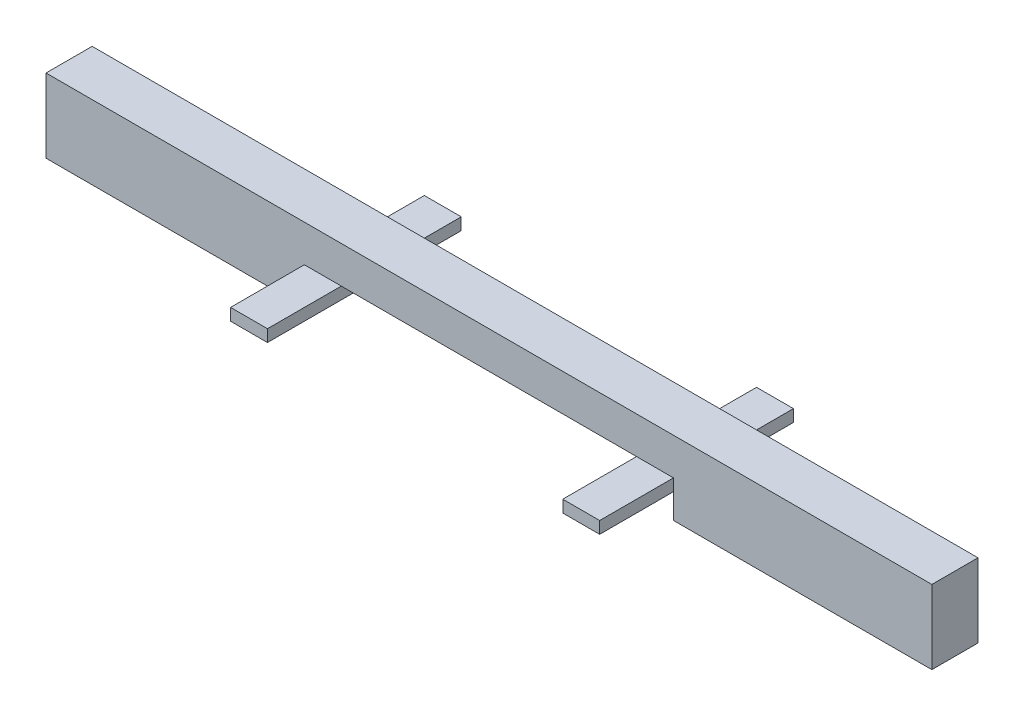
ISO-10303-21;
HEADER;
FILE_DESCRIPTION(('STEP AP214'),'2;1');
FILE_NAME('part.step','',(''),(''),'','','');
FILE_SCHEMA(('AUTOMOTIVE_DESIGN { 1 0 10303 214 1 1 1 1 }'));
ENDSEC;
DATA;
#1=APPLICATION_CONTEXT('core data for automotive mechanical design processes');
#2=APPLICATION_PROTOCOL_DEFINITION('international standard','automotive_design',2000,#1);
#3=PRODUCT_CONTEXT('',#1,'mechanical');
#4=PRODUCT('Part','Part','',(#3));
#5=PRODUCT_RELATED_PRODUCT_CATEGORY('part','',(#4));
#6=PRODUCT_DEFINITION_FORMATION('','',#4);
#7=PRODUCT_DEFINITION_CONTEXT('part definition',#1,'design');
#8=PRODUCT_DEFINITION('design','',#6,#7);
#9=PRODUCT_DEFINITION_SHAPE('','',#8);
#10=(LENGTH_UNIT() NAMED_UNIT(*) SI_UNIT(.MILLI.,.METRE.));
#11=(NAMED_UNIT(*) PLANE_ANGLE_UNIT() SI_UNIT($,.RADIAN.));
#12=(NAMED_UNIT(*) SI_UNIT($,.STERADIAN.) SOLID_ANGLE_UNIT());
#13=UNCERTAINTY_MEASURE_WITH_UNIT(LENGTH_MEASURE(1.E-05),#10,'distance_accuracy_value','');
#14=(GEOMETRIC_REPRESENTATION_CONTEXT(3) GLOBAL_UNCERTAINTY_ASSIGNED_CONTEXT((#13)) GLOBAL_UNIT_ASSIGNED_CONTEXT((#10,
#11,#12)) REPRESENTATION_CONTEXT('',''));
#15=CARTESIAN_POINT('',(0.,0.,0.));
#16=DIRECTION('',(0.,0.,1.));
#17=DIRECTION('',(1.,0.,0.));
#18=AXIS2_PLACEMENT_3D('',#15,#16,#17);
#19=CARTESIAN_POINT('',(0.,0.,0.));
#20=DIRECTION('',(0.,0.,-1.));
#21=DIRECTION('',(-1.,0.,0.));
#22=AXIS2_PLACEMENT_3D('',#19,#20,#21);
#23=PLANE('',#22);
#24=DIRECTION('',(1.,0.,0.));
#25=VECTOR('',#24,1.);
#26=CARTESIAN_POINT('',(1.,0.,0.));
#27=LINE('',#26,#25);
#28=CARTESIAN_POINT('',(0.,0.,0.));
#29=VERTEX_POINT('',#28);
#30=CARTESIAN_POINT('',(1.,0.,0.));
#31=VERTEX_POINT('',#30);
#32=EDGE_CURVE('E209',#29,#31,#27,.T.);
#33=ORIENTED_EDGE('',*,*,#32,.F.);
#34=DIRECTION('',(0.,1.,0.));
#35=VECTOR('',#34,1.);
#36=CARTESIAN_POINT('',(0.,-0.325,0.));
#37=LINE('',#36,#35);
#38=CARTESIAN_POINT('',(0.,-0.325,0.));
#39=VERTEX_POINT('',#38);
#40=EDGE_CURVE('E212',#39,#29,#37,.T.);
#41=ORIENTED_EDGE('',*,*,#40,.F.);
#42=DIRECTION('',(0.,1.,0.));
#43=VECTOR('',#42,1.);
#44=CARTESIAN_POINT('',(0.,-0.325,0.));
#45=LINE('',#44,#43);
#46=CARTESIAN_POINT('',(0.,-1.,0.));
#47=VERTEX_POINT('',#46);
#48=EDGE_CURVE('E358',#47,#39,#45,.T.);
#49=ORIENTED_EDGE('',*,*,#48,.F.);
#50=DIRECTION('',(1.,0.,0.));
#51=VECTOR('',#50,1.);
#52=CARTESIAN_POINT('',(0.,-1.,0.));
#53=LINE('',#52,#51);
#54=CARTESIAN_POINT('',(-7.,-1.,0.));
#55=VERTEX_POINT('',#54);
#56=EDGE_CURVE('E355',#55,#47,#53,.T.);
#57=ORIENTED_EDGE('',*,*,#56,.F.);
#58=DIRECTION('',(0.,-1.,0.));
#59=VECTOR('',#58,1.);
#60=CARTESIAN_POINT('',(-7.,0.999999999999999,0.));
#61=LINE('',#60,#59);
#62=CARTESIAN_POINT('',(-7.,0.999999999999999,0.));
#63=VERTEX_POINT('',#62);
#64=EDGE_CURVE('E352',#63,#55,#61,.T.);
#65=ORIENTED_EDGE('',*,*,#64,.F.);
#66=DIRECTION('',(-1.,0.,0.));
#67=VECTOR('',#66,1.);
#68=CARTESIAN_POINT('',(0.,1.,0.));
#69=LINE('',#68,#67);
#70=CARTESIAN_POINT('',(17.,1.,0.));
#71=VERTEX_POINT('',#70);
#72=EDGE_CURVE('E323',#71,#63,#69,.T.);
#73=ORIENTED_EDGE('',*,*,#72,.F.);
#74=DIRECTION('',(0.,1.,0.));
#75=VECTOR('',#74,1.);
#76=CARTESIAN_POINT('',(17.,1.,0.));
#77=LINE('',#76,#75);
#78=CARTESIAN_POINT('',(17.,-1.,0.));
#79=VERTEX_POINT('',#78);
#80=EDGE_CURVE('E328',#79,#71,#77,.T.);
#81=ORIENTED_EDGE('',*,*,#80,.F.);
#82=DIRECTION('',(1.,0.,0.));
#83=VECTOR('',#82,1.);
#84=CARTESIAN_POINT('',(10.,-1.,0.));
#85=LINE('',#84,#83);
#86=CARTESIAN_POINT('',(10.,-1.,0.));
#87=VERTEX_POINT('',#86);
#88=EDGE_CURVE('E369',#87,#79,#85,.T.);
#89=ORIENTED_EDGE('',*,*,#88,.F.);
#90=DIRECTION('',(0.,-1.,0.));
#91=VECTOR('',#90,1.);
#92=CARTESIAN_POINT('',(10.,-0.325,0.));
#93=LINE('',#92,#91);
#94=CARTESIAN_POINT('',(10.,-0.325,0.));
#95=VERTEX_POINT('',#94);
#96=EDGE_CURVE('E366',#95,#87,#93,.T.);
#97=ORIENTED_EDGE('',*,*,#96,.F.);
#98=DIRECTION('',(0.,-1.,0.));
#99=VECTOR('',#98,1.);
#100=CARTESIAN_POINT('',(10.,-0.325,0.));
#101=LINE('',#100,#99);
#102=CARTESIAN_POINT('',(10.,0.,0.));
#103=VERTEX_POINT('',#102);
#104=EDGE_CURVE('E234',#103,#95,#101,.T.);
#105=ORIENTED_EDGE('',*,*,#104,.F.);
#106=DIRECTION('',(1.,0.,0.));
#107=VECTOR('',#106,1.);
#108=CARTESIAN_POINT('',(9.,0.,0.));
#109=LINE('',#108,#107);
#110=CARTESIAN_POINT('',(9.,0.,0.));
#111=VERTEX_POINT('',#110);
#112=EDGE_CURVE('E228',#111,#103,#109,.T.);
#113=ORIENTED_EDGE('',*,*,#112,.F.);
#114=DIRECTION('',(1.,0.,0.));
#115=VECTOR('',#114,1.);
#116=CARTESIAN_POINT('',(1.,0.,0.));
#117=LINE('',#116,#115);
#118=EDGE_CURVE('E362',#31,#111,#117,.T.);
#119=ORIENTED_EDGE('',*,*,#118,.F.);
#120=EDGE_LOOP('',(#33,#41,#49,#57,#65,#73,#81,#89,#97,#105,#113,#119));
#121=FACE_BOUND('',#120,.T.);
#122=ADVANCED_FACE('F39',(#121),#23,.T.);
#123=CARTESIAN_POINT('',(0.,0.,1.25));
#124=DIRECTION('',(0.,0.,-1.));
#125=DIRECTION('',(-1.,0.,0.));
#126=AXIS2_PLACEMENT_3D('',#123,#124,#125);
#127=PLANE('',#126);
#128=DIRECTION('',(0.,1.,0.));
#129=VECTOR('',#128,1.);
#130=CARTESIAN_POINT('',(10.,-0.325,1.25));
#131=LINE('',#130,#129);
#132=CARTESIAN_POINT('',(10.,-0.325,1.25));
#133=VERTEX_POINT('',#132);
#134=CARTESIAN_POINT('',(10.,0.,1.25));
#135=VERTEX_POINT('',#134);
#136=EDGE_CURVE('E262',#133,#135,#131,.T.);
#137=ORIENTED_EDGE('',*,*,#136,.F.);
#138=DIRECTION('',(0.,-1.,0.));
#139=VECTOR('',#138,1.);
#140=CARTESIAN_POINT('',(10.,-0.325,1.25));
#141=LINE('',#140,#139);
#142=CARTESIAN_POINT('',(10.,-1.,1.25));
#143=VERTEX_POINT('',#142);
#144=EDGE_CURVE('E340',#133,#143,#141,.T.);
#145=ORIENTED_EDGE('',*,*,#144,.T.);
#146=DIRECTION('',(1.,0.,0.));
#147=VECTOR('',#146,1.);
#148=CARTESIAN_POINT('',(10.,-1.,1.25));
#149=LINE('',#148,#147);
#150=CARTESIAN_POINT('',(17.,-1.,1.25));
#151=VERTEX_POINT('',#150);
#152=EDGE_CURVE('E343',#143,#151,#149,.T.);
#153=ORIENTED_EDGE('',*,*,#152,.T.);
#154=DIRECTION('',(0.,1.,0.));
#155=VECTOR('',#154,1.);
#156=CARTESIAN_POINT('',(17.,1.,1.25));
#157=LINE('',#156,#155);
#158=CARTESIAN_POINT('',(17.,1.,1.25));
#159=VERTEX_POINT('',#158);
#160=EDGE_CURVE('E346',#151,#159,#157,.T.);
#161=ORIENTED_EDGE('',*,*,#160,.T.);
#162=DIRECTION('',(-1.,0.,0.));
#163=VECTOR('',#162,1.);
#164=CARTESIAN_POINT('',(10.,1.,1.25));
#165=LINE('',#164,#163);
#166=CARTESIAN_POINT('',(-7.,0.999999999999999,1.25));
#167=VERTEX_POINT('',#166);
#168=EDGE_CURVE('E324',#159,#167,#165,.T.);
#169=ORIENTED_EDGE('',*,*,#168,.T.);
#170=DIRECTION('',(0.,-1.,0.));
#171=VECTOR('',#170,1.);
#172=CARTESIAN_POINT('',(-7.,0.999999999999999,1.25));
#173=LINE('',#172,#171);
#174=CARTESIAN_POINT('',(-7.,-1.,1.25));
#175=VERTEX_POINT('',#174);
#176=EDGE_CURVE('E327',#167,#175,#173,.T.);
#177=ORIENTED_EDGE('',*,*,#176,.T.);
#178=DIRECTION('',(1.,0.,0.));
#179=VECTOR('',#178,1.);
#180=CARTESIAN_POINT('',(0.,-1.,1.25));
#181=LINE('',#180,#179);
#182=CARTESIAN_POINT('',(0.,-1.,1.25));
#183=VERTEX_POINT('',#182);
#184=EDGE_CURVE('E331',#175,#183,#181,.T.);
#185=ORIENTED_EDGE('',*,*,#184,.T.);
#186=DIRECTION('',(0.,1.,0.));
#187=VECTOR('',#186,1.);
#188=CARTESIAN_POINT('',(0.,-0.325,1.25));
#189=LINE('',#188,#187);
#190=CARTESIAN_POINT('',(0.,-0.325,1.25));
#191=VERTEX_POINT('',#190);
#192=EDGE_CURVE('E334',#183,#191,#189,.T.);
#193=ORIENTED_EDGE('',*,*,#192,.T.);
#194=DIRECTION('',(0.,-1.,0.));
#195=VECTOR('',#194,1.);
#196=CARTESIAN_POINT('',(0.,-0.325,1.25));
#197=LINE('',#196,#195);
#198=CARTESIAN_POINT('',(0.,0.,1.25));
#199=VERTEX_POINT('',#198);
#200=EDGE_CURVE('E296',#199,#191,#197,.T.);
#201=ORIENTED_EDGE('',*,*,#200,.F.);
#202=DIRECTION('',(-1.,0.,0.));
#203=VECTOR('',#202,1.);
#204=CARTESIAN_POINT('',(1.,0.,1.25));
#205=LINE('',#204,#203);
#206=CARTESIAN_POINT('',(1.,0.,1.25));
#207=VERTEX_POINT('',#206);
#208=EDGE_CURVE('E292',#207,#199,#205,.T.);
#209=ORIENTED_EDGE('',*,*,#208,.F.);
#210=DIRECTION('',(1.,0.,0.));
#211=VECTOR('',#210,1.);
#212=CARTESIAN_POINT('',(1.,0.,1.25));
#213=LINE('',#212,#211);
#214=CARTESIAN_POINT('',(9.,0.,1.25));
#215=VERTEX_POINT('',#214);
#216=EDGE_CURVE('E337',#207,#215,#213,.T.);
#217=ORIENTED_EDGE('',*,*,#216,.T.);
#218=DIRECTION('',(-1.,0.,0.));
#219=VECTOR('',#218,1.);
#220=CARTESIAN_POINT('',(9.,0.,1.25));
#221=LINE('',#220,#219);
#222=EDGE_CURVE('E63',#135,#215,#221,.T.);
#223=ORIENTED_EDGE('',*,*,#222,.F.);
#224=EDGE_LOOP('',(#137,#145,#153,#161,#169,#177,#185,#193,#201,#209,#217,#223));
#225=FACE_BOUND('',#224,.T.);
#226=ADVANCED_FACE('F428',(#225),#127,.F.);
#227=CARTESIAN_POINT('',(0.,1.,1.25));
#228=DIRECTION('',(0.,-1.,0.));
#229=DIRECTION('',(1.,0.,0.));
#230=AXIS2_PLACEMENT_3D('',#227,#228,#229);
#231=PLANE('',#230);
#232=ORIENTED_EDGE('',*,*,#72,.T.);
#233=DIRECTION('',(0.,0.,-1.));
#234=VECTOR('',#233,1.);
#235=CARTESIAN_POINT('',(-7.,0.999999999999999,1.25));
#236=LINE('',#235,#234);
#237=EDGE_CURVE('E11',#167,#63,#236,.T.);
#238=ORIENTED_EDGE('',*,*,#237,.F.);
#239=ORIENTED_EDGE('',*,*,#168,.F.);
#240=DIRECTION('',(0.,0.,-1.));
#241=VECTOR('',#240,1.);
#242=CARTESIAN_POINT('',(17.,1.,1.25));
#243=LINE('',#242,#241);
#244=EDGE_CURVE('E349',#159,#71,#243,.T.);
#245=ORIENTED_EDGE('',*,*,#244,.T.);
#246=EDGE_LOOP('',(#232,#238,#239,#245));
#247=FACE_BOUND('',#246,.T.);
#248=ADVANCED_FACE('F41',(#247),#231,.F.);
#249=CARTESIAN_POINT('',(-7.,0.999999999999999,1.25));
#250=DIRECTION('',(1.,0.,0.));
#251=DIRECTION('',(0.,1.,0.));
#252=AXIS2_PLACEMENT_3D('',#249,#250,#251);
#253=PLANE('',#252);
#254=ORIENTED_EDGE('',*,*,#64,.T.);
#255=DIRECTION('',(0.,0.,-1.));
#256=VECTOR('',#255,1.);
#257=CARTESIAN_POINT('',(-7.,-1.,1.25));
#258=LINE('',#257,#256);
#259=EDGE_CURVE('E48',#175,#55,#258,.T.);
#260=ORIENTED_EDGE('',*,*,#259,.F.);
#261=ORIENTED_EDGE('',*,*,#176,.F.);
#262=ORIENTED_EDGE('',*,*,#237,.T.);
#263=EDGE_LOOP('',(#254,#260,#261,#262));
#264=FACE_BOUND('',#263,.T.);
#265=ADVANCED_FACE('F472',(#264),#253,.F.);
#266=CARTESIAN_POINT('',(0.,-1.,1.25));
#267=DIRECTION('',(0.,1.,0.));
#268=DIRECTION('',(-1.,0.,0.));
#269=AXIS2_PLACEMENT_3D('',#266,#267,#268);
#270=PLANE('',#269);
#271=ORIENTED_EDGE('',*,*,#56,.T.);
#272=DIRECTION('',(0.,0.,-1.));
#273=VECTOR('',#272,1.);
#274=CARTESIAN_POINT('',(0.,-1.,1.25));
#275=LINE('',#274,#273);
#276=EDGE_CURVE('E401',#183,#47,#275,.T.);
#277=ORIENTED_EDGE('',*,*,#276,.F.);
#278=ORIENTED_EDGE('',*,*,#184,.F.);
#279=ORIENTED_EDGE('',*,*,#259,.T.);
#280=EDGE_LOOP('',(#271,#277,#278,#279));
#281=FACE_BOUND('',#280,.T.);
#282=ADVANCED_FACE('F410',(#281),#270,.F.);
#283=CARTESIAN_POINT('',(0.,-0.325,1.25));
#284=DIRECTION('',(-1.,0.,0.));
#285=DIRECTION('',(0.,-1.,0.));
#286=AXIS2_PLACEMENT_3D('',#283,#284,#285);
#287=PLANE('',#286);
#288=ORIENTED_EDGE('',*,*,#48,.T.);
#289=DIRECTION('',(0.,0.,-1.));
#290=VECTOR('',#289,1.);
#291=CARTESIAN_POINT('',(0.,-0.325,1.25));
#292=LINE('',#291,#290);
#293=EDGE_CURVE('E192',#191,#39,#292,.T.);
#294=ORIENTED_EDGE('',*,*,#293,.F.);
#295=ORIENTED_EDGE('',*,*,#192,.F.);
#296=ORIENTED_EDGE('',*,*,#276,.T.);
#297=EDGE_LOOP('',(#288,#294,#295,#296));
#298=FACE_BOUND('',#297,.T.);
#299=ADVANCED_FACE('F421',(#298),#287,.F.);
#300=CARTESIAN_POINT('',(0.,-0.325,1.25));
#301=DIRECTION('',(0.,1.,0.));
#302=DIRECTION('',(0.,0.,1.));
#303=AXIS2_PLACEMENT_3D('',#300,#301,#302);
#304=PLANE('',#303);
#305=ORIENTED_EDGE('',*,*,#293,.T.);
#306=DIRECTION('',(0.,0.,1.));
#307=VECTOR('',#306,1.);
#308=CARTESIAN_POINT('',(0.,-0.325,-2.));
#309=LINE('',#308,#307);
#310=CARTESIAN_POINT('',(0.,-0.325,-2.));
#311=VERTEX_POINT('',#310);
#312=EDGE_CURVE('E199',#311,#39,#309,.T.);
#313=ORIENTED_EDGE('',*,*,#312,.F.);
#314=DIRECTION('',(-1.,0.,0.));
#315=VECTOR('',#314,1.);
#316=CARTESIAN_POINT('',(1.,-0.325,-2.));
#317=LINE('',#316,#315);
#318=CARTESIAN_POINT('',(1.,-0.325,-2.));
#319=VERTEX_POINT('',#318);
#320=EDGE_CURVE('E196',#319,#311,#317,.T.);
#321=ORIENTED_EDGE('',*,*,#320,.F.);
#322=DIRECTION('',(0.,0.,-1.));
#323=VECTOR('',#322,1.);
#324=CARTESIAN_POINT('',(1.,-0.325,1.25));
#325=LINE('',#324,#323);
#326=CARTESIAN_POINT('',(1.,-0.325,3.25));
#327=VERTEX_POINT('',#326);
#328=EDGE_CURVE('E179',#327,#319,#325,.T.);
#329=ORIENTED_EDGE('',*,*,#328,.F.);
#330=DIRECTION('',(1.,0.,0.));
#331=VECTOR('',#330,1.);
#332=CARTESIAN_POINT('',(1.,-0.325,3.25));
#333=LINE('',#332,#331);
#334=CARTESIAN_POINT('',(0.,-0.325,3.25));
#335=VERTEX_POINT('',#334);
#336=EDGE_CURVE('E302',#335,#327,#333,.T.);
#337=ORIENTED_EDGE('',*,*,#336,.F.);
#338=DIRECTION('',(0.,0.,-1.));
#339=VECTOR('',#338,1.);
#340=CARTESIAN_POINT('',(0.,-0.325,3.25));
#341=LINE('',#340,#339);
#342=EDGE_CURVE('E305',#335,#191,#341,.T.);
#343=ORIENTED_EDGE('',*,*,#342,.T.);
#344=EDGE_LOOP('',(#305,#313,#321,#329,#337,#343));
#345=FACE_BOUND('',#344,.T.);
#346=ADVANCED_FACE('F198',(#345),#304,.F.);
#347=CARTESIAN_POINT('',(1.,0.,1.25));
#348=DIRECTION('',(-1.,0.,0.));
#349=DIRECTION('',(0.,0.,1.));
#350=AXIS2_PLACEMENT_3D('',#347,#348,#349);
#351=PLANE('',#350);
#352=ORIENTED_EDGE('',*,*,#328,.T.);
#353=DIRECTION('',(0.,-1.,0.));
#354=VECTOR('',#353,1.);
#355=CARTESIAN_POINT('',(1.,-0.325,-2.));
#356=LINE('',#355,#354);
#357=CARTESIAN_POINT('',(1.,0.,-2.));
#358=VERTEX_POINT('',#357);
#359=EDGE_CURVE('E184',#358,#319,#356,.T.);
#360=ORIENTED_EDGE('',*,*,#359,.F.);
#361=DIRECTION('',(0.,0.,1.));
#362=VECTOR('',#361,1.);
#363=CARTESIAN_POINT('',(1.,0.,-2.));
#364=LINE('',#363,#362);
#365=EDGE_CURVE('E219',#358,#31,#364,.T.);
#366=ORIENTED_EDGE('',*,*,#365,.T.);
#367=DIRECTION('',(0.,0.,-1.));
#368=VECTOR('',#367,1.);
#369=CARTESIAN_POINT('',(1.,0.,1.25));
#370=LINE('',#369,#368);
#371=EDGE_CURVE('E193',#207,#31,#370,.T.);
#372=ORIENTED_EDGE('',*,*,#371,.F.);
#373=DIRECTION('',(0.,0.,-1.));
#374=VECTOR('',#373,1.);
#375=CARTESIAN_POINT('',(1.,0.,3.25));
#376=LINE('',#375,#374);
#377=CARTESIAN_POINT('',(1.,0.,3.25));
#378=VERTEX_POINT('',#377);
#379=EDGE_CURVE('E319',#378,#207,#376,.T.);
#380=ORIENTED_EDGE('',*,*,#379,.F.);
#381=DIRECTION('',(0.,1.,0.));
#382=VECTOR('',#381,1.);
#383=CARTESIAN_POINT('',(1.,-0.325,3.25));
#384=LINE('',#383,#382);
#385=EDGE_CURVE('E187',#327,#378,#384,.T.);
#386=ORIENTED_EDGE('',*,*,#385,.F.);
#387=EDGE_LOOP('',(#352,#360,#366,#372,#380,#386));
#388=FACE_BOUND('',#387,.T.);
#389=ADVANCED_FACE('F181',(#388),#351,.F.);
#390=CARTESIAN_POINT('',(1.,0.,1.25));
#391=DIRECTION('',(0.,1.,0.));
#392=DIRECTION('',(-1.,0.,0.));
#393=AXIS2_PLACEMENT_3D('',#390,#391,#392);
#394=PLANE('',#393);
#395=ORIENTED_EDGE('',*,*,#118,.T.);
#396=DIRECTION('',(0.,0.,-1.));
#397=VECTOR('',#396,1.);
#398=CARTESIAN_POINT('',(9.,0.,1.25));
#399=LINE('',#398,#397);
#400=EDGE_CURVE('E392',#215,#111,#399,.T.);
#401=ORIENTED_EDGE('',*,*,#400,.F.);
#402=ORIENTED_EDGE('',*,*,#216,.F.);
#403=ORIENTED_EDGE('',*,*,#371,.T.);
#404=EDGE_LOOP('',(#395,#401,#402,#403));
#405=FACE_BOUND('',#404,.T.);
#406=ADVANCED_FACE('F436',(#405),#394,.F.);
#407=CARTESIAN_POINT('',(9.,0.,1.25));
#408=DIRECTION('',(1.,0.,0.));
#409=DIRECTION('',(0.,0.,-1.));
#410=AXIS2_PLACEMENT_3D('',#407,#408,#409);
#411=PLANE('',#410);
#412=ORIENTED_EDGE('',*,*,#400,.T.);
#413=DIRECTION('',(0.,0.,1.));
#414=VECTOR('',#413,1.);
#415=CARTESIAN_POINT('',(9.,0.,-2.));
#416=LINE('',#415,#414);
#417=CARTESIAN_POINT('',(9.,0.,-2.));
#418=VERTEX_POINT('',#417);
#419=EDGE_CURVE('E258',#418,#111,#416,.T.);
#420=ORIENTED_EDGE('',*,*,#419,.F.);
#421=DIRECTION('',(0.,1.,0.));
#422=VECTOR('',#421,1.);
#423=CARTESIAN_POINT('',(9.,-0.325,-2.));
#424=LINE('',#423,#422);
#425=CARTESIAN_POINT('',(9.,-0.325,-2.));
#426=VERTEX_POINT('',#425);
#427=EDGE_CURVE('E229',#426,#418,#424,.T.);
#428=ORIENTED_EDGE('',*,*,#427,.F.);
#429=DIRECTION('',(0.,0.,-1.));
#430=VECTOR('',#429,1.);
#431=CARTESIAN_POINT('',(9.,-0.325,1.25));
#432=LINE('',#431,#430);
#433=CARTESIAN_POINT('',(9.,-0.325,3.25));
#434=VERTEX_POINT('',#433);
#435=EDGE_CURVE('E389',#434,#426,#432,.T.);
#436=ORIENTED_EDGE('',*,*,#435,.F.);
#437=DIRECTION('',(0.,-1.,0.));
#438=VECTOR('',#437,1.);
#439=CARTESIAN_POINT('',(9.,-0.325,3.25));
#440=LINE('',#439,#438);
#441=CARTESIAN_POINT('',(9.,0.,3.25));
#442=VERTEX_POINT('',#441);
#443=EDGE_CURVE('E263',#442,#434,#440,.T.);
#444=ORIENTED_EDGE('',*,*,#443,.F.);
#445=DIRECTION('',(0.,0.,-1.));
#446=VECTOR('',#445,1.);
#447=CARTESIAN_POINT('',(9.,0.,3.25));
#448=LINE('',#447,#446);
#449=EDGE_CURVE('E276',#442,#215,#448,.T.);
#450=ORIENTED_EDGE('',*,*,#449,.T.);
#451=EDGE_LOOP('',(#412,#420,#428,#436,#444,#450));
#452=FACE_BOUND('',#451,.T.);
#453=ADVANCED_FACE('F445',(#452),#411,.F.);
#454=CARTESIAN_POINT('',(10.,-0.325,1.25));
#455=DIRECTION('',(0.,1.,0.));
#456=DIRECTION('',(-1.,0.,0.));
#457=AXIS2_PLACEMENT_3D('',#454,#455,#456);
#458=PLANE('',#457);
#459=ORIENTED_EDGE('',*,*,#435,.T.);
#460=DIRECTION('',(-1.,0.,0.));
#461=VECTOR('',#460,1.);
#462=CARTESIAN_POINT('',(9.,-0.325,-2.));
#463=LINE('',#462,#461);
#464=CARTESIAN_POINT('',(10.,-0.325,-2.));
#465=VERTEX_POINT('',#464);
#466=EDGE_CURVE('E240',#465,#426,#463,.T.);
#467=ORIENTED_EDGE('',*,*,#466,.F.);
#468=DIRECTION('',(0.,0.,1.));
#469=VECTOR('',#468,1.);
#470=CARTESIAN_POINT('',(10.,-0.325,-2.));
#471=LINE('',#470,#469);
#472=EDGE_CURVE('E244',#465,#95,#471,.T.);
#473=ORIENTED_EDGE('',*,*,#472,.T.);
#474=DIRECTION('',(0.,0.,-1.));
#475=VECTOR('',#474,1.);
#476=CARTESIAN_POINT('',(10.,-0.325,1.25));
#477=LINE('',#476,#475);
#478=EDGE_CURVE('E386',#133,#95,#477,.T.);
#479=ORIENTED_EDGE('',*,*,#478,.F.);
#480=DIRECTION('',(0.,0.,-1.));
#481=VECTOR('',#480,1.);
#482=CARTESIAN_POINT('',(10.,-0.325,3.25));
#483=LINE('',#482,#481);
#484=CARTESIAN_POINT('',(10.,-0.325,3.25));
#485=VERTEX_POINT('',#484);
#486=EDGE_CURVE('E288',#485,#133,#483,.T.);
#487=ORIENTED_EDGE('',*,*,#486,.F.);
#488=DIRECTION('',(1.,0.,0.));
#489=VECTOR('',#488,1.);
#490=CARTESIAN_POINT('',(9.,-0.325,3.25));
#491=LINE('',#490,#489);
#492=EDGE_CURVE('E267',#434,#485,#491,.T.);
#493=ORIENTED_EDGE('',*,*,#492,.F.);
#494=EDGE_LOOP('',(#459,#467,#473,#479,#487,#493));
#495=FACE_BOUND('',#494,.T.);
#496=ADVANCED_FACE('F493',(#495),#458,.F.);
#497=CARTESIAN_POINT('',(10.,-0.325,1.25));
#498=DIRECTION('',(1.,0.,0.));
#499=DIRECTION('',(0.,0.,-1.));
#500=AXIS2_PLACEMENT_3D('',#497,#498,#499);
#501=PLANE('',#500);
#502=ORIENTED_EDGE('',*,*,#96,.T.);
#503=DIRECTION('',(0.,0.,-1.));
#504=VECTOR('',#503,1.);
#505=CARTESIAN_POINT('',(10.,-1.,1.25));
#506=LINE('',#505,#504);
#507=EDGE_CURVE('E382',#143,#87,#506,.T.);
#508=ORIENTED_EDGE('',*,*,#507,.F.);
#509=ORIENTED_EDGE('',*,*,#144,.F.);
#510=ORIENTED_EDGE('',*,*,#478,.T.);
#511=EDGE_LOOP('',(#502,#508,#509,#510));
#512=FACE_BOUND('',#511,.T.);
#513=ADVANCED_FACE('F459',(#512),#501,.F.);
#514=CARTESIAN_POINT('',(10.,-1.,1.25));
#515=DIRECTION('',(0.,1.,0.));
#516=DIRECTION('',(0.,0.,1.));
#517=AXIS2_PLACEMENT_3D('',#514,#515,#516);
#518=PLANE('',#517);
#519=ORIENTED_EDGE('',*,*,#88,.T.);
#520=DIRECTION('',(0.,0.,-1.));
#521=VECTOR('',#520,1.);
#522=CARTESIAN_POINT('',(17.,-1.,1.25));
#523=LINE('',#522,#521);
#524=EDGE_CURVE('E378',#151,#79,#523,.T.);
#525=ORIENTED_EDGE('',*,*,#524,.F.);
#526=ORIENTED_EDGE('',*,*,#152,.F.);
#527=ORIENTED_EDGE('',*,*,#507,.T.);
#528=EDGE_LOOP('',(#519,#525,#526,#527));
#529=FACE_BOUND('',#528,.T.);
#530=ADVANCED_FACE('F463',(#529),#518,.F.);
#531=CARTESIAN_POINT('',(17.,1.,1.25));
#532=DIRECTION('',(-1.,0.,0.));
#533=DIRECTION('',(0.,0.,1.));
#534=AXIS2_PLACEMENT_3D('',#531,#532,#533);
#535=PLANE('',#534);
#536=ORIENTED_EDGE('',*,*,#80,.T.);
#537=ORIENTED_EDGE('',*,*,#244,.F.);
#538=ORIENTED_EDGE('',*,*,#160,.F.);
#539=ORIENTED_EDGE('',*,*,#524,.T.);
#540=EDGE_LOOP('',(#536,#537,#538,#539));
#541=FACE_BOUND('',#540,.T.);
#542=ADVANCED_FACE('F468',(#541),#535,.F.);
#543=CARTESIAN_POINT('',(1.,0.,3.25));
#544=DIRECTION('',(0.,-1.,0.));
#545=DIRECTION('',(0.,0.,-1.));
#546=AXIS2_PLACEMENT_3D('',#543,#544,#545);
#547=PLANE('',#546);
#548=ORIENTED_EDGE('',*,*,#208,.T.);
#549=DIRECTION('',(0.,0.,-1.));
#550=VECTOR('',#549,1.);
#551=CARTESIAN_POINT('',(0.,0.,3.25));
#552=LINE('',#551,#550);
#553=CARTESIAN_POINT('',(0.,0.,3.25));
#554=VERTEX_POINT('',#553);
#555=EDGE_CURVE('E315',#554,#199,#552,.T.);
#556=ORIENTED_EDGE('',*,*,#555,.F.);
#557=DIRECTION('',(-1.,0.,0.));
#558=VECTOR('',#557,1.);
#559=CARTESIAN_POINT('',(1.,0.,3.25));
#560=LINE('',#559,#558);
#561=EDGE_CURVE('E295',#378,#554,#560,.T.);
#562=ORIENTED_EDGE('',*,*,#561,.F.);
#563=ORIENTED_EDGE('',*,*,#379,.T.);
#564=EDGE_LOOP('',(#548,#556,#562,#563));
#565=FACE_BOUND('',#564,.T.);
#566=ADVANCED_FACE('F431',(#565),#547,.F.);
#567=CARTESIAN_POINT('',(0.,-0.325,3.25));
#568=DIRECTION('',(1.,0.,0.));
#569=DIRECTION('',(0.,0.,-1.));
#570=AXIS2_PLACEMENT_3D('',#567,#568,#569);
#571=PLANE('',#570);
#572=ORIENTED_EDGE('',*,*,#200,.T.);
#573=ORIENTED_EDGE('',*,*,#342,.F.);
#574=DIRECTION('',(0.,-1.,0.));
#575=VECTOR('',#574,1.);
#576=CARTESIAN_POINT('',(0.,-0.325,3.25));
#577=LINE('',#576,#575);
#578=EDGE_CURVE('E299',#554,#335,#577,.T.);
#579=ORIENTED_EDGE('',*,*,#578,.F.);
#580=ORIENTED_EDGE('',*,*,#555,.T.);
#581=EDGE_LOOP('',(#572,#573,#579,#580));
#582=FACE_BOUND('',#581,.T.);
#583=ADVANCED_FACE('F426',(#582),#571,.F.);
#584=CARTESIAN_POINT('',(0.,0.,3.25));
#585=DIRECTION('',(0.,0.,1.));
#586=DIRECTION('',(1.,0.,0.));
#587=AXIS2_PLACEMENT_3D('',#584,#585,#586);
#588=PLANE('',#587);
#589=ORIENTED_EDGE('',*,*,#385,.T.);
#590=ORIENTED_EDGE('',*,*,#561,.T.);
#591=ORIENTED_EDGE('',*,*,#578,.T.);
#592=ORIENTED_EDGE('',*,*,#336,.T.);
#593=EDGE_LOOP('',(#589,#590,#591,#592));
#594=FACE_BOUND('',#593,.T.);
#595=ADVANCED_FACE('F555',(#594),#588,.T.);
#596=CARTESIAN_POINT('',(10.,-0.325,3.25));
#597=DIRECTION('',(-1.,0.,0.));
#598=DIRECTION('',(0.,0.,1.));
#599=AXIS2_PLACEMENT_3D('',#596,#597,#598);
#600=PLANE('',#599);
#601=ORIENTED_EDGE('',*,*,#136,.T.);
#602=DIRECTION('',(0.,0.,-1.));
#603=VECTOR('',#602,1.);
#604=CARTESIAN_POINT('',(10.,0.,3.25));
#605=LINE('',#604,#603);
#606=CARTESIAN_POINT('',(10.,0.,3.25));
#607=VERTEX_POINT('',#606);
#608=EDGE_CURVE('E284',#607,#135,#605,.T.);
#609=ORIENTED_EDGE('',*,*,#608,.F.);
#610=DIRECTION('',(0.,1.,0.));
#611=VECTOR('',#610,1.);
#612=CARTESIAN_POINT('',(10.,-0.325,3.25));
#613=LINE('',#612,#611);
#614=EDGE_CURVE('E270',#485,#607,#613,.T.);
#615=ORIENTED_EDGE('',*,*,#614,.F.);
#616=ORIENTED_EDGE('',*,*,#486,.T.);
#617=EDGE_LOOP('',(#601,#609,#615,#616));
#618=FACE_BOUND('',#617,.T.);
#619=ADVANCED_FACE('F453',(#618),#600,.F.);
#620=CARTESIAN_POINT('',(9.,0.,3.25));
#621=DIRECTION('',(0.,-1.,0.));
#622=DIRECTION('',(0.,0.,-1.));
#623=AXIS2_PLACEMENT_3D('',#620,#621,#622);
#624=PLANE('',#623);
#625=ORIENTED_EDGE('',*,*,#222,.T.);
#626=ORIENTED_EDGE('',*,*,#449,.F.);
#627=DIRECTION('',(-1.,0.,0.));
#628=VECTOR('',#627,1.);
#629=CARTESIAN_POINT('',(9.,0.,3.25));
#630=LINE('',#629,#628);
#631=EDGE_CURVE('E273',#607,#442,#630,.T.);
#632=ORIENTED_EDGE('',*,*,#631,.F.);
#633=ORIENTED_EDGE('',*,*,#608,.T.);
#634=EDGE_LOOP('',(#625,#626,#632,#633));
#635=FACE_BOUND('',#634,.T.);
#636=ADVANCED_FACE('F441',(#635),#624,.F.);
#637=CARTESIAN_POINT('',(0.,0.,3.25));
#638=DIRECTION('',(0.,0.,-1.));
#639=DIRECTION('',(-1.,0.,0.));
#640=AXIS2_PLACEMENT_3D('',#637,#638,#639);
#641=PLANE('',#640);
#642=ORIENTED_EDGE('',*,*,#443,.T.);
#643=ORIENTED_EDGE('',*,*,#492,.T.);
#644=ORIENTED_EDGE('',*,*,#614,.T.);
#645=ORIENTED_EDGE('',*,*,#631,.T.);
#646=EDGE_LOOP('',(#642,#643,#644,#645));
#647=FACE_BOUND('',#646,.T.);
#648=ADVANCED_FACE('F449',(#647),#641,.F.);
#649=CARTESIAN_POINT('',(9.,0.,-2.));
#650=DIRECTION('',(0.,-1.,0.));
#651=DIRECTION('',(1.,0.,0.));
#652=AXIS2_PLACEMENT_3D('',#649,#650,#651);
#653=PLANE('',#652);
#654=ORIENTED_EDGE('',*,*,#112,.T.);
#655=DIRECTION('',(0.,0.,1.));
#656=VECTOR('',#655,1.);
#657=CARTESIAN_POINT('',(10.,0.,-2.));
#658=LINE('',#657,#656);
#659=CARTESIAN_POINT('',(10.,0.,-2.));
#660=VERTEX_POINT('',#659);
#661=EDGE_CURVE('E254',#660,#103,#658,.T.);
#662=ORIENTED_EDGE('',*,*,#661,.F.);
#663=DIRECTION('',(1.,0.,0.));
#664=VECTOR('',#663,1.);
#665=CARTESIAN_POINT('',(9.,0.,-2.));
#666=LINE('',#665,#664);
#667=EDGE_CURVE('E233',#418,#660,#666,.T.);
#668=ORIENTED_EDGE('',*,*,#667,.F.);
#669=ORIENTED_EDGE('',*,*,#419,.T.);
#670=EDGE_LOOP('',(#654,#662,#668,#669));
#671=FACE_BOUND('',#670,.T.);
#672=ADVANCED_FACE('F581',(#671),#653,.F.);
#673=CARTESIAN_POINT('',(10.,-0.325,-2.));
#674=DIRECTION('',(-1.,0.,0.));
#675=DIRECTION('',(0.,0.,1.));
#676=AXIS2_PLACEMENT_3D('',#673,#674,#675);
#677=PLANE('',#676);
#678=ORIENTED_EDGE('',*,*,#104,.T.);
#679=ORIENTED_EDGE('',*,*,#472,.F.);
#680=DIRECTION('',(0.,-1.,0.));
#681=VECTOR('',#680,1.);
#682=CARTESIAN_POINT('',(10.,-0.325,-2.));
#683=LINE('',#682,#681);
#684=EDGE_CURVE('E237',#660,#465,#683,.T.);
#685=ORIENTED_EDGE('',*,*,#684,.F.);
#686=ORIENTED_EDGE('',*,*,#661,.T.);
#687=EDGE_LOOP('',(#678,#679,#685,#686));
#688=FACE_BOUND('',#687,.T.);
#689=ADVANCED_FACE('F587',(#688),#677,.F.);
#690=CARTESIAN_POINT('',(0.,0.,-2.));
#691=DIRECTION('',(0.,0.,-1.));
#692=DIRECTION('',(-1.,0.,0.));
#693=AXIS2_PLACEMENT_3D('',#690,#691,#692);
#694=PLANE('',#693);
#695=ORIENTED_EDGE('',*,*,#427,.T.);
#696=ORIENTED_EDGE('',*,*,#667,.T.);
#697=ORIENTED_EDGE('',*,*,#684,.T.);
#698=ORIENTED_EDGE('',*,*,#466,.T.);
#699=EDGE_LOOP('',(#695,#696,#697,#698));
#700=FACE_BOUND('',#699,.T.);
#701=ADVANCED_FACE('F595',(#700),#694,.T.);
#702=CARTESIAN_POINT('',(0.,-0.325,-2.));
#703=DIRECTION('',(1.,0.,0.));
#704=DIRECTION('',(0.,0.,-1.));
#705=AXIS2_PLACEMENT_3D('',#702,#703,#704);
#706=PLANE('',#705);
#707=ORIENTED_EDGE('',*,*,#40,.T.);
#708=DIRECTION('',(0.,0.,1.));
#709=VECTOR('',#708,1.);
#710=CARTESIAN_POINT('',(0.,0.,-2.));
#711=LINE('',#710,#709);
#712=CARTESIAN_POINT('',(0.,0.,-2.));
#713=VERTEX_POINT('',#712);
#714=EDGE_CURVE('E55',#713,#29,#711,.T.);
#715=ORIENTED_EDGE('',*,*,#714,.F.);
#716=DIRECTION('',(0.,1.,0.));
#717=VECTOR('',#716,1.);
#718=CARTESIAN_POINT('',(0.,-0.325,-2.));
#719=LINE('',#718,#717);
#720=EDGE_CURVE('E203',#311,#713,#719,.T.);
#721=ORIENTED_EDGE('',*,*,#720,.F.);
#722=ORIENTED_EDGE('',*,*,#312,.T.);
#723=EDGE_LOOP('',(#707,#715,#721,#722));
#724=FACE_BOUND('',#723,.T.);
#725=ADVANCED_FACE('F603',(#724),#706,.F.);
#726=CARTESIAN_POINT('',(1.,0.,-2.));
#727=DIRECTION('',(0.,-1.,0.));
#728=DIRECTION('',(0.,0.,-1.));
#729=AXIS2_PLACEMENT_3D('',#726,#727,#728);
#730=PLANE('',#729);
#731=ORIENTED_EDGE('',*,*,#32,.T.);
#732=ORIENTED_EDGE('',*,*,#365,.F.);
#733=DIRECTION('',(1.,0.,0.));
#734=VECTOR('',#733,1.);
#735=CARTESIAN_POINT('',(1.,0.,-2.));
#736=LINE('',#735,#734);
#737=EDGE_CURVE('E206',#713,#358,#736,.T.);
#738=ORIENTED_EDGE('',*,*,#737,.F.);
#739=ORIENTED_EDGE('',*,*,#714,.T.);
#740=EDGE_LOOP('',(#731,#732,#738,#739));
#741=FACE_BOUND('',#740,.T.);
#742=ADVANCED_FACE('F611',(#741),#730,.F.);
#743=CARTESIAN_POINT('',(0.,0.,-2.));
#744=DIRECTION('',(0.,0.,1.));
#745=DIRECTION('',(1.,0.,0.));
#746=AXIS2_PLACEMENT_3D('',#743,#744,#745);
#747=PLANE('',#746);
#748=ORIENTED_EDGE('',*,*,#359,.T.);
#749=ORIENTED_EDGE('',*,*,#320,.T.);
#750=ORIENTED_EDGE('',*,*,#720,.T.);
#751=ORIENTED_EDGE('',*,*,#737,.T.);
#752=EDGE_LOOP('',(#748,#749,#750,#751));
#753=FACE_BOUND('',#752,.T.);
#754=ADVANCED_FACE('F205',(#753),#747,.F.);
#755=CLOSED_SHELL('',(#122,#226,#248,#265,#282,#299,#346,#389,#406,#453,#496,#513,#530,#542,
#566,#583,#595,#619,#636,#648,#672,#689,#701,#725,#742,#754));
#756=MANIFOLD_SOLID_BREP('B2',#755);
#757=ADVANCED_BREP_SHAPE_REPRESENTATION('',(#18,#756),#14);
#758=SHAPE_DEFINITION_REPRESENTATION(#9,#757);
ENDSEC;
END-ISO-10303-21;
